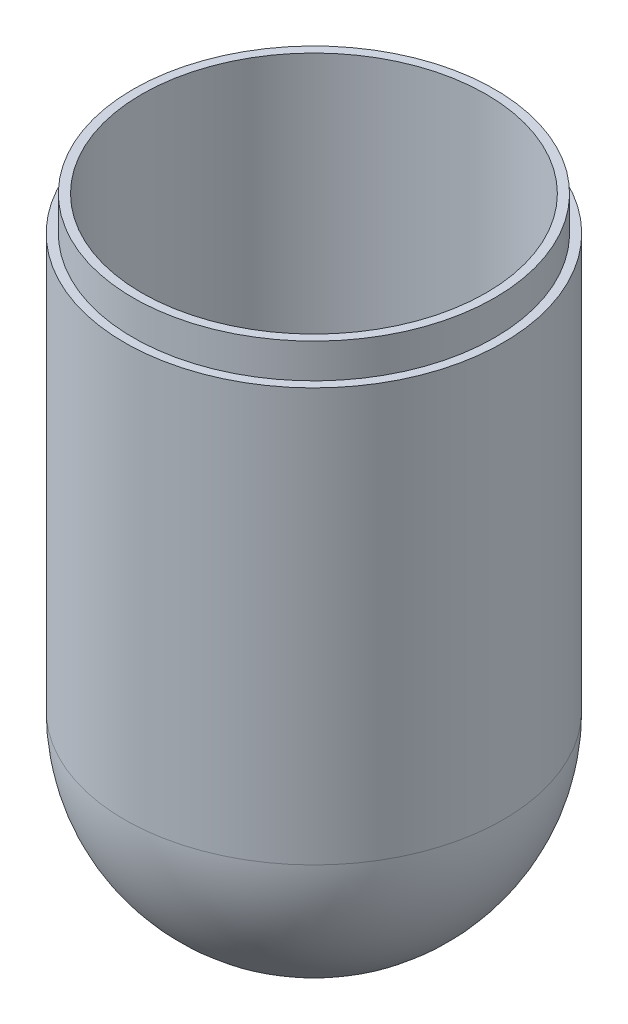
ISO-10303-21;
HEADER;
FILE_DESCRIPTION(('STEP AP214'),'2;1');
FILE_NAME('part.step','',(''),(''),'','','');
FILE_SCHEMA(('AUTOMOTIVE_DESIGN { 1 0 10303 214 1 1 1 1 }'));
ENDSEC;
DATA;
#1=APPLICATION_CONTEXT('core data for automotive mechanical design processes');
#2=APPLICATION_PROTOCOL_DEFINITION('international standard','automotive_design',2000,#1);
#3=PRODUCT_CONTEXT('',#1,'mechanical');
#4=PRODUCT('Part','Part','',(#3));
#5=PRODUCT_RELATED_PRODUCT_CATEGORY('part','',(#4));
#6=PRODUCT_DEFINITION_FORMATION('','',#4);
#7=PRODUCT_DEFINITION_CONTEXT('part definition',#1,'design');
#8=PRODUCT_DEFINITION('design','',#6,#7);
#9=PRODUCT_DEFINITION_SHAPE('','',#8);
#10=(LENGTH_UNIT() NAMED_UNIT(*) SI_UNIT(.MILLI.,.METRE.));
#11=(NAMED_UNIT(*) PLANE_ANGLE_UNIT() SI_UNIT($,.RADIAN.));
#12=(NAMED_UNIT(*) SI_UNIT($,.STERADIAN.) SOLID_ANGLE_UNIT());
#13=UNCERTAINTY_MEASURE_WITH_UNIT(LENGTH_MEASURE(1.E-05),#10,'distance_accuracy_value','');
#14=(GEOMETRIC_REPRESENTATION_CONTEXT(3) GLOBAL_UNCERTAINTY_ASSIGNED_CONTEXT((#13)) GLOBAL_UNIT_ASSIGNED_CONTEXT((#10,
#11,#12)) REPRESENTATION_CONTEXT('',''));
#15=CARTESIAN_POINT('',(0.,0.,0.));
#16=DIRECTION('',(0.,0.,1.));
#17=DIRECTION('',(1.,0.,0.));
#18=AXIS2_PLACEMENT_3D('',#15,#16,#17);
#19=CARTESIAN_POINT('',(0.,165.1,0.));
#20=DIRECTION('',(0.,-1.,0.));
#21=DIRECTION('',(1.,0.,0.));
#22=AXIS2_PLACEMENT_3D('',#19,#20,#21);
#23=CYLINDRICAL_SURFACE('',#22,66.675);
#24=CARTESIAN_POINT('',(0.,152.4,0.));
#25=DIRECTION('',(0.,-1.,0.));
#26=DIRECTION('',(1.,0.,0.));
#27=AXIS2_PLACEMENT_3D('',#24,#25,#26);
#28=CIRCLE('',#27,66.675);
#29=CARTESIAN_POINT('',(66.675,152.4,0.));
#30=VERTEX_POINT('',#29);
#31=EDGE_CURVE('E10',#30,#30,#28,.F.);
#32=ORIENTED_EDGE('',*,*,#31,.T.);
#33=EDGE_LOOP('',(#32));
#34=FACE_BOUND('',#33,.T.);
#35=CARTESIAN_POINT('',(0.,165.1,0.));
#36=DIRECTION('',(0.,1.,0.));
#37=DIRECTION('',(-1.,0.,0.));
#38=AXIS2_PLACEMENT_3D('',#35,#36,#37);
#39=CIRCLE('',#38,66.675);
#40=CARTESIAN_POINT('',(-66.675,165.1,0.));
#41=VERTEX_POINT('',#40);
#42=EDGE_CURVE('E56',#41,#41,#39,.T.);
#43=ORIENTED_EDGE('',*,*,#42,.F.);
#44=EDGE_LOOP('',(#43));
#45=FACE_BOUND('',#44,.T.);
#46=ADVANCED_FACE('F33',(#34,#45),#23,.T.);
#47=CARTESIAN_POINT('',(63.5,152.4,0.));
#48=DIRECTION('',(0.,-1.,0.));
#49=DIRECTION('',(1.,0.,0.));
#50=AXIS2_PLACEMENT_3D('',#47,#48,#49);
#51=PLANE('',#50);
#52=CARTESIAN_POINT('',(0.,152.4,0.));
#53=DIRECTION('',(0.,1.,0.));
#54=DIRECTION('',(-1.,0.,0.));
#55=AXIS2_PLACEMENT_3D('',#52,#53,#54);
#56=CIRCLE('',#55,69.85);
#57=CARTESIAN_POINT('',(-69.8500000000001,152.4,0.));
#58=VERTEX_POINT('',#57);
#59=EDGE_CURVE('E48',#58,#58,#56,.T.);
#60=ORIENTED_EDGE('',*,*,#59,.T.);
#61=EDGE_LOOP('',(#60));
#62=FACE_BOUND('',#61,.T.);
#63=ORIENTED_EDGE('',*,*,#31,.F.);
#64=EDGE_LOOP('',(#63));
#65=FACE_BOUND('',#64,.T.);
#66=ADVANCED_FACE('F63',(#62,#65),#51,.F.);
#67=CARTESIAN_POINT('',(0.,0.,0.));
#68=DIRECTION('',(0.,1.,0.));
#69=DIRECTION('',(-1.,0.,0.));
#70=AXIS2_PLACEMENT_3D('',#67,#68,#69);
#71=SPHERICAL_SURFACE('',#70,69.85);
#72=CARTESIAN_POINT('',(0.,0.,0.));
#73=DIRECTION('',(0.,1.,0.));
#74=DIRECTION('',(-1.,0.,0.));
#75=AXIS2_PLACEMENT_3D('',#72,#73,#74);
#76=CIRCLE('',#75,69.85);
#77=CARTESIAN_POINT('',(-69.85,0.,0.));
#78=VERTEX_POINT('',#77);
#79=EDGE_CURVE('E40',#78,#78,#76,.T.);
#80=ORIENTED_EDGE('',*,*,#79,.F.);
#81=EDGE_LOOP('',(#80));
#82=FACE_BOUND('',#81,.T.);
#83=ADVANCED_FACE('F69',(#82),#71,.T.);
#84=CARTESIAN_POINT('',(0.,-63.5,0.));
#85=DIRECTION('',(0.,1.,0.));
#86=DIRECTION('',(-1.,0.,0.));
#87=AXIS2_PLACEMENT_3D('',#84,#85,#86);
#88=CYLINDRICAL_SURFACE('',#87,69.85);
#89=ORIENTED_EDGE('',*,*,#79,.T.);
#90=EDGE_LOOP('',(#89));
#91=FACE_BOUND('',#90,.T.);
#92=ORIENTED_EDGE('',*,*,#59,.F.);
#93=EDGE_LOOP('',(#92));
#94=FACE_BOUND('',#93,.T.);
#95=ADVANCED_FACE('F78',(#91,#94),#88,.T.);
#96=CARTESIAN_POINT('',(0.,0.,0.));
#97=DIRECTION('',(0.,1.,0.));
#98=DIRECTION('',(1.,0.,0.));
#99=AXIS2_PLACEMENT_3D('',#96,#97,#98);
#100=SPHERICAL_SURFACE('',#99,63.5);
#101=CARTESIAN_POINT('',(0.,0.,0.));
#102=DIRECTION('',(0.,1.,0.));
#103=DIRECTION('',(-1.,0.,0.));
#104=AXIS2_PLACEMENT_3D('',#101,#102,#103);
#105=CIRCLE('',#104,63.5);
#106=CARTESIAN_POINT('',(-63.5,0.,0.));
#107=VERTEX_POINT('',#106);
#108=EDGE_CURVE('E44',#107,#107,#105,.T.);
#109=ORIENTED_EDGE('',*,*,#108,.T.);
#110=EDGE_LOOP('',(#109));
#111=FACE_BOUND('',#110,.T.);
#112=ADVANCED_FACE('F35',(#111),#100,.F.);
#113=CARTESIAN_POINT('',(0.,-63.5,0.));
#114=DIRECTION('',(0.,1.,0.));
#115=DIRECTION('',(-1.,0.,0.));
#116=AXIS2_PLACEMENT_3D('',#113,#114,#115);
#117=CYLINDRICAL_SURFACE('',#116,63.5);
#118=ORIENTED_EDGE('',*,*,#108,.F.);
#119=EDGE_LOOP('',(#118));
#120=FACE_BOUND('',#119,.T.);
#121=CARTESIAN_POINT('',(0.,165.1,0.));
#122=DIRECTION('',(0.,1.,0.));
#123=DIRECTION('',(-1.,0.,0.));
#124=AXIS2_PLACEMENT_3D('',#121,#122,#123);
#125=CIRCLE('',#124,63.5);
#126=CARTESIAN_POINT('',(-63.5,165.1,0.));
#127=VERTEX_POINT('',#126);
#128=EDGE_CURVE('E53',#127,#127,#125,.T.);
#129=ORIENTED_EDGE('',*,*,#128,.T.);
#130=EDGE_LOOP('',(#129));
#131=FACE_BOUND('',#130,.T.);
#132=ADVANCED_FACE('F74',(#120,#131),#117,.F.);
#133=CARTESIAN_POINT('',(0.,165.1,0.));
#134=DIRECTION('',(0.,1.,0.));
#135=DIRECTION('',(-1.,0.,0.));
#136=AXIS2_PLACEMENT_3D('',#133,#134,#135);
#137=PLANE('',#136);
#138=ORIENTED_EDGE('',*,*,#128,.F.);
#139=EDGE_LOOP('',(#138));
#140=FACE_BOUND('',#139,.T.);
#141=ORIENTED_EDGE('',*,*,#42,.T.);
#142=EDGE_LOOP('',(#141));
#143=FACE_BOUND('',#142,.T.);
#144=ADVANCED_FACE('F60',(#140,#143),#137,.T.);
#145=CLOSED_SHELL('',(#46,#66,#83,#95,#112,#132,#144));
#146=MANIFOLD_SOLID_BREP('B2',#145);
#147=ADVANCED_BREP_SHAPE_REPRESENTATION('',(#18,#146),#14);
#148=SHAPE_DEFINITION_REPRESENTATION(#9,#147);
ENDSEC;
END-ISO-10303-21;
